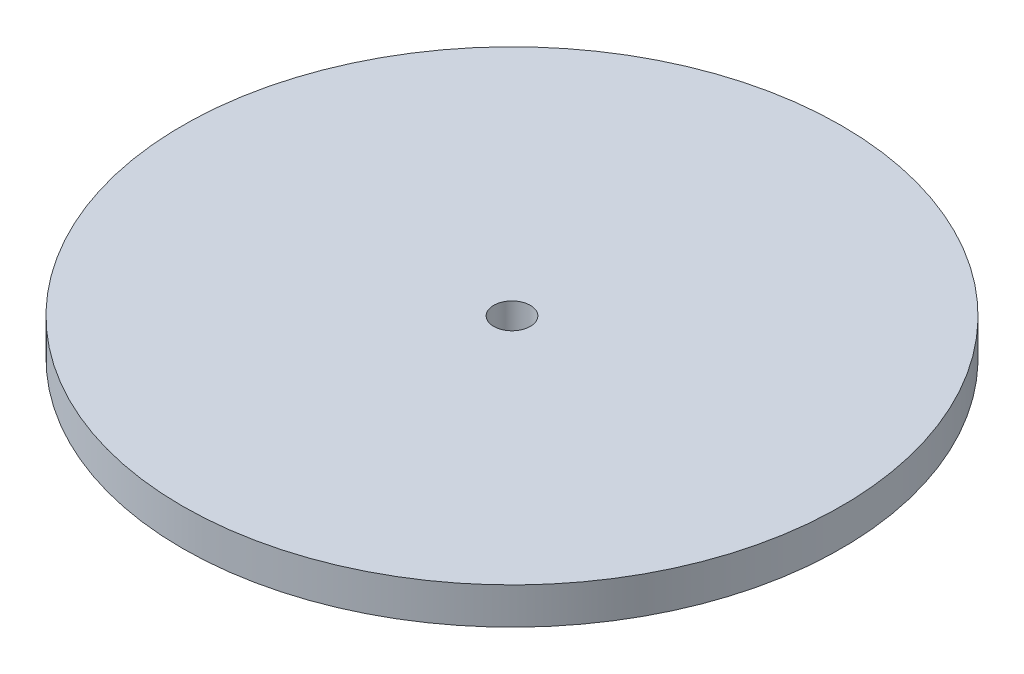
ISO-10303-21;
HEADER;
FILE_DESCRIPTION(('STEP AP214'),'2;1');
FILE_NAME('part.step','',(''),(''),'','','');
FILE_SCHEMA(('AUTOMOTIVE_DESIGN { 1 0 10303 214 1 1 1 1 }'));
ENDSEC;
DATA;
#1=APPLICATION_CONTEXT('core data for automotive mechanical design processes');
#2=APPLICATION_PROTOCOL_DEFINITION('international standard','automotive_design',2000,#1);
#3=PRODUCT_CONTEXT('',#1,'mechanical');
#4=PRODUCT('Part','Part','',(#3));
#5=PRODUCT_RELATED_PRODUCT_CATEGORY('part','',(#4));
#6=PRODUCT_DEFINITION_FORMATION('','',#4);
#7=PRODUCT_DEFINITION_CONTEXT('part definition',#1,'design');
#8=PRODUCT_DEFINITION('design','',#6,#7);
#9=PRODUCT_DEFINITION_SHAPE('','',#8);
#10=(LENGTH_UNIT() NAMED_UNIT(*) SI_UNIT(.MILLI.,.METRE.));
#11=(NAMED_UNIT(*) PLANE_ANGLE_UNIT() SI_UNIT($,.RADIAN.));
#12=(NAMED_UNIT(*) SI_UNIT($,.STERADIAN.) SOLID_ANGLE_UNIT());
#13=UNCERTAINTY_MEASURE_WITH_UNIT(LENGTH_MEASURE(1.E-05),#10,'distance_accuracy_value','');
#14=(GEOMETRIC_REPRESENTATION_CONTEXT(3) GLOBAL_UNCERTAINTY_ASSIGNED_CONTEXT((#13)) GLOBAL_UNIT_ASSIGNED_CONTEXT((#10,
#11,#12)) REPRESENTATION_CONTEXT('',''));
#15=CARTESIAN_POINT('',(0.,0.,0.));
#16=DIRECTION('',(0.,0.,1.));
#17=DIRECTION('',(1.,0.,0.));
#18=AXIS2_PLACEMENT_3D('',#15,#16,#17);
#19=CARTESIAN_POINT('',(0.,10.,0.));
#20=DIRECTION('',(0.,-1.,0.));
#21=DIRECTION('',(0.,0.,-1.));
#22=AXIS2_PLACEMENT_3D('',#19,#20,#21);
#23=CYLINDRICAL_SURFACE('',#22,90.);
#24=CARTESIAN_POINT('',(0.,10.,0.));
#25=DIRECTION('',(0.,1.,0.));
#26=DIRECTION('',(0.,0.,1.));
#27=AXIS2_PLACEMENT_3D('',#24,#25,#26);
#28=CIRCLE('',#27,90.);
#29=CARTESIAN_POINT('',(0.,10.,90.));
#30=VERTEX_POINT('',#29);
#31=EDGE_CURVE('E10',#30,#30,#28,.T.);
#32=ORIENTED_EDGE('',*,*,#31,.F.);
#33=EDGE_LOOP('',(#32));
#34=FACE_BOUND('',#33,.T.);
#35=CARTESIAN_POINT('',(0.,0.,0.));
#36=DIRECTION('',(0.,1.,0.));
#37=DIRECTION('',(0.,0.,1.));
#38=AXIS2_PLACEMENT_3D('',#35,#36,#37);
#39=CIRCLE('',#38,90.);
#40=CARTESIAN_POINT('',(0.,0.,90.));
#41=VERTEX_POINT('',#40);
#42=EDGE_CURVE('E35',#41,#41,#39,.T.);
#43=ORIENTED_EDGE('',*,*,#42,.T.);
#44=EDGE_LOOP('',(#43));
#45=FACE_BOUND('',#44,.T.);
#46=ADVANCED_FACE('F32',(#34,#45),#23,.T.);
#47=CARTESIAN_POINT('',(0.,10.,0.));
#48=DIRECTION('',(0.,1.,0.));
#49=DIRECTION('',(0.,0.,1.));
#50=AXIS2_PLACEMENT_3D('',#47,#48,#49);
#51=PLANE('',#50);
#52=CARTESIAN_POINT('',(0.,10.,0.));
#53=DIRECTION('',(0.,1.,0.));
#54=DIRECTION('',(0.,0.,1.));
#55=AXIS2_PLACEMENT_3D('',#52,#53,#54);
#56=CIRCLE('',#55,5.);
#57=CARTESIAN_POINT('',(0.,10.,5.));
#58=VERTEX_POINT('',#57);
#59=EDGE_CURVE('E44',#58,#58,#56,.T.);
#60=ORIENTED_EDGE('',*,*,#59,.F.);
#61=EDGE_LOOP('',(#60));
#62=FACE_BOUND('',#61,.T.);
#63=ORIENTED_EDGE('',*,*,#31,.T.);
#64=EDGE_LOOP('',(#63));
#65=FACE_BOUND('',#64,.T.);
#66=ADVANCED_FACE('F59',(#62,#65),#51,.T.);
#67=CARTESIAN_POINT('',(0.,0.,0.));
#68=DIRECTION('',(0.,1.,0.));
#69=DIRECTION('',(0.,0.,1.));
#70=AXIS2_PLACEMENT_3D('',#67,#68,#69);
#71=PLANE('',#70);
#72=CARTESIAN_POINT('',(0.,0.,0.));
#73=DIRECTION('',(0.,1.,0.));
#74=DIRECTION('',(0.,0.,1.));
#75=AXIS2_PLACEMENT_3D('',#72,#73,#74);
#76=CIRCLE('',#75,5.);
#77=CARTESIAN_POINT('',(0.,0.,5.));
#78=VERTEX_POINT('',#77);
#79=EDGE_CURVE('E42',#78,#78,#76,.T.);
#80=ORIENTED_EDGE('',*,*,#79,.T.);
#81=EDGE_LOOP('',(#80));
#82=FACE_BOUND('',#81,.T.);
#83=ORIENTED_EDGE('',*,*,#42,.F.);
#84=EDGE_LOOP('',(#83));
#85=FACE_BOUND('',#84,.T.);
#86=ADVANCED_FACE('F50',(#82,#85),#71,.F.);
#87=CARTESIAN_POINT('',(0.,0.,0.));
#88=DIRECTION('',(0.,1.,0.));
#89=DIRECTION('',(0.,0.,1.));
#90=AXIS2_PLACEMENT_3D('',#87,#88,#89);
#91=CYLINDRICAL_SURFACE('',#90,5.);
#92=ORIENTED_EDGE('',*,*,#79,.F.);
#93=EDGE_LOOP('',(#92));
#94=FACE_BOUND('',#93,.T.);
#95=ORIENTED_EDGE('',*,*,#59,.T.);
#96=EDGE_LOOP('',(#95));
#97=FACE_BOUND('',#96,.T.);
#98=ADVANCED_FACE('F53',(#94,#97),#91,.F.);
#99=CLOSED_SHELL('',(#46,#66,#86,#98));
#100=MANIFOLD_SOLID_BREP('B2',#99);
#101=ADVANCED_BREP_SHAPE_REPRESENTATION('',(#18,#100),#14);
#102=SHAPE_DEFINITION_REPRESENTATION(#9,#101);
ENDSEC;
END-ISO-10303-21;
